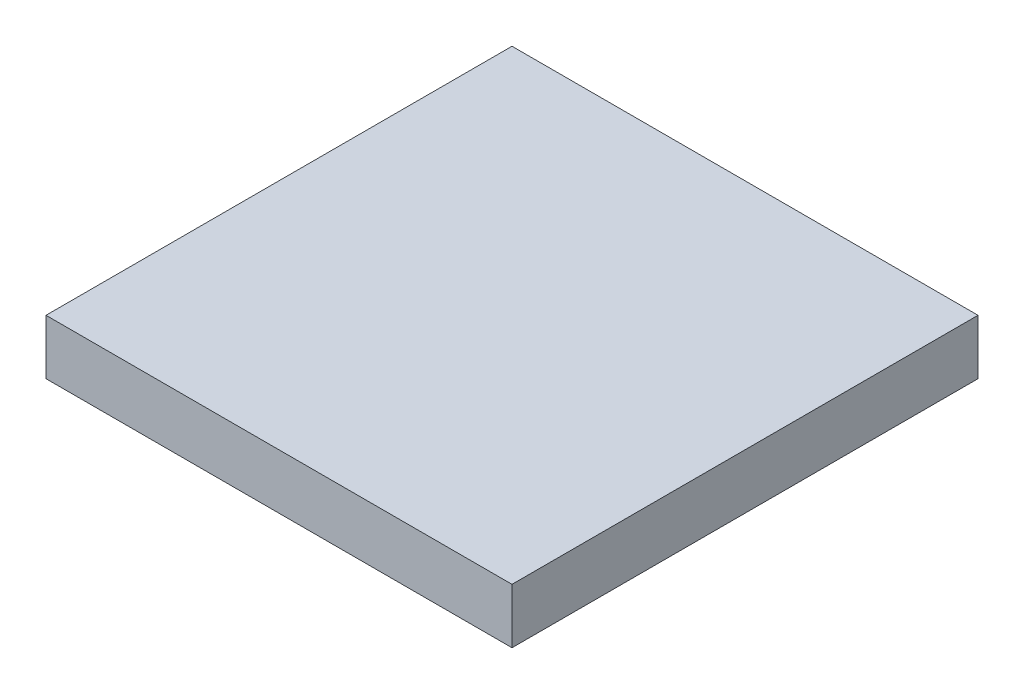
ISO-10303-21;
HEADER;
FILE_DESCRIPTION(('STEP AP214'),'2;1');
FILE_NAME('part.step','',(''),(''),'','','');
FILE_SCHEMA(('AUTOMOTIVE_DESIGN { 1 0 10303 214 1 1 1 1 }'));
ENDSEC;
DATA;
#1=APPLICATION_CONTEXT('core data for automotive mechanical design processes');
#2=APPLICATION_PROTOCOL_DEFINITION('international standard','automotive_design',2000,#1);
#3=PRODUCT_CONTEXT('',#1,'mechanical');
#4=PRODUCT('Part','Part','',(#3));
#5=PRODUCT_RELATED_PRODUCT_CATEGORY('part','',(#4));
#6=PRODUCT_DEFINITION_FORMATION('','',#4);
#7=PRODUCT_DEFINITION_CONTEXT('part definition',#1,'design');
#8=PRODUCT_DEFINITION('design','',#6,#7);
#9=PRODUCT_DEFINITION_SHAPE('','',#8);
#10=(LENGTH_UNIT() NAMED_UNIT(*) SI_UNIT(.MILLI.,.METRE.));
#11=(NAMED_UNIT(*) PLANE_ANGLE_UNIT() SI_UNIT($,.RADIAN.));
#12=(NAMED_UNIT(*) SI_UNIT($,.STERADIAN.) SOLID_ANGLE_UNIT());
#13=UNCERTAINTY_MEASURE_WITH_UNIT(LENGTH_MEASURE(1.E-05),#10,'distance_accuracy_value','');
#14=(GEOMETRIC_REPRESENTATION_CONTEXT(3) GLOBAL_UNCERTAINTY_ASSIGNED_CONTEXT((#13)) GLOBAL_UNIT_ASSIGNED_CONTEXT((#10,
#11,#12)) REPRESENTATION_CONTEXT('',''));
#15=CARTESIAN_POINT('',(0.,0.,0.));
#16=DIRECTION('',(0.,0.,1.));
#17=DIRECTION('',(1.,0.,0.));
#18=AXIS2_PLACEMENT_3D('',#15,#16,#17);
#19=CARTESIAN_POINT('',(1.3040420762004,8.17060732929226,34.5373110434945));
#20=DIRECTION('',(0.,1.,0.));
#21=DIRECTION('',(1.,0.,0.));
#22=AXIS2_PLACEMENT_3D('',#19,#20,#21);
#23=PLANE('',#22);
#24=DIRECTION('',(1.,0.,0.));
#25=VECTOR('',#24,1.);
#26=CARTESIAN_POINT('',(1.66377375309118,8.17060732929226,42.1535957080219));
#27=LINE('',#26,#25);
#28=CARTESIAN_POINT('',(-3.08622624690882,8.17060732929226,42.1535957080219));
#29=VERTEX_POINT('',#28);
#30=CARTESIAN_POINT('',(1.66377375309118,8.17060732929226,42.1535957080219));
#31=VERTEX_POINT('',#30);
#32=EDGE_CURVE('E90',#29,#31,#27,.T.);
#33=ORIENTED_EDGE('',*,*,#32,.T.);
#34=DIRECTION('',(0.,0.,-1.));
#35=VECTOR('',#34,1.);
#36=CARTESIAN_POINT('',(1.66377375309118,8.17060732929226,46.9035957080219));
#37=LINE('',#36,#35);
#38=CARTESIAN_POINT('',(1.66377375309118,8.17060732929226,46.9035957080219));
#39=VERTEX_POINT('',#38);
#40=EDGE_CURVE('E70',#31,#39,#37,.F.);
#41=ORIENTED_EDGE('',*,*,#40,.T.);
#42=DIRECTION('',(1.,0.,0.));
#43=VECTOR('',#42,1.);
#44=CARTESIAN_POINT('',(1.66377375309118,8.17060732929226,46.9035957080219));
#45=LINE('',#44,#43);
#46=CARTESIAN_POINT('',(-3.08622624690882,8.17060732929226,46.9035957080219));
#47=VERTEX_POINT('',#46);
#48=EDGE_CURVE('E56',#39,#47,#45,.F.);
#49=ORIENTED_EDGE('',*,*,#48,.T.);
#50=DIRECTION('',(0.,0.,-1.));
#51=VECTOR('',#50,1.);
#52=CARTESIAN_POINT('',(-3.08622624690882,8.17060732929226,46.9035957080219));
#53=LINE('',#52,#51);
#54=EDGE_CURVE('E20',#47,#29,#53,.T.);
#55=ORIENTED_EDGE('',*,*,#54,.T.);
#56=EDGE_LOOP('',(#33,#41,#49,#55));
#57=FACE_BOUND('',#56,.T.);
#58=ADVANCED_FACE('F17',(#57),#23,.F.);
#59=CARTESIAN_POINT('',(-3.08622624690882,8.73060732929226,46.9035957080219));
#60=DIRECTION('',(1.,0.,0.));
#61=DIRECTION('',(0.,-1.,0.));
#62=AXIS2_PLACEMENT_3D('',#59,#60,#61);
#63=PLANE('',#62);
#64=DIRECTION('',(0.,1.,0.));
#65=VECTOR('',#64,1.);
#66=CARTESIAN_POINT('',(-3.08622624690882,8.73060732929226,46.9035957080219));
#67=LINE('',#66,#65);
#68=CARTESIAN_POINT('',(-3.08622624690882,8.73060732929226,46.9035957080219));
#69=VERTEX_POINT('',#68);
#70=EDGE_CURVE('E62',#47,#69,#67,.T.);
#71=ORIENTED_EDGE('',*,*,#70,.T.);
#72=DIRECTION('',(0.,0.,-1.));
#73=VECTOR('',#72,1.);
#74=CARTESIAN_POINT('',(-3.08622624690882,8.73060732929226,34.5373110434945));
#75=LINE('',#74,#73);
#76=CARTESIAN_POINT('',(-3.08622624690882,8.73060732929226,42.1535957080219));
#77=VERTEX_POINT('',#76);
#78=EDGE_CURVE('E93',#77,#69,#75,.F.);
#79=ORIENTED_EDGE('',*,*,#78,.F.);
#80=DIRECTION('',(0.,1.,0.));
#81=VECTOR('',#80,1.);
#82=CARTESIAN_POINT('',(-3.08622624690882,8.73060732929226,42.1535957080219));
#83=LINE('',#82,#81);
#84=EDGE_CURVE('E65',#77,#29,#83,.F.);
#85=ORIENTED_EDGE('',*,*,#84,.T.);
#86=ORIENTED_EDGE('',*,*,#54,.F.);
#87=EDGE_LOOP('',(#71,#79,#85,#86));
#88=FACE_BOUND('',#87,.T.);
#89=ADVANCED_FACE('F61',(#88),#63,.F.);
#90=CARTESIAN_POINT('',(1.66377375309118,8.73060732929226,46.9035957080219));
#91=DIRECTION('',(0.,0.,-1.));
#92=DIRECTION('',(0.,1.,0.));
#93=AXIS2_PLACEMENT_3D('',#90,#91,#92);
#94=PLANE('',#93);
#95=DIRECTION('',(0.,1.,0.));
#96=VECTOR('',#95,1.);
#97=CARTESIAN_POINT('',(1.66377375309118,8.73060732929226,46.9035957080219));
#98=LINE('',#97,#96);
#99=CARTESIAN_POINT('',(1.66377375309118,8.73060732929226,46.9035957080219));
#100=VERTEX_POINT('',#99);
#101=EDGE_CURVE('E73',#39,#100,#98,.T.);
#102=ORIENTED_EDGE('',*,*,#101,.T.);
#103=DIRECTION('',(1.,0.,0.));
#104=VECTOR('',#103,1.);
#105=CARTESIAN_POINT('',(1.3040420762004,8.73060732929226,46.9035957080219));
#106=LINE('',#105,#104);
#107=EDGE_CURVE('E77',#69,#100,#106,.T.);
#108=ORIENTED_EDGE('',*,*,#107,.F.);
#109=ORIENTED_EDGE('',*,*,#70,.F.);
#110=ORIENTED_EDGE('',*,*,#48,.F.);
#111=EDGE_LOOP('',(#102,#108,#109,#110));
#112=FACE_BOUND('',#111,.T.);
#113=ADVANCED_FACE('F75',(#112),#94,.F.);
#114=CARTESIAN_POINT('',(1.66377375309118,8.73060732929226,46.9035957080219));
#115=DIRECTION('',(-1.,0.,0.));
#116=DIRECTION('',(0.,1.,0.));
#117=AXIS2_PLACEMENT_3D('',#114,#115,#116);
#118=PLANE('',#117);
#119=DIRECTION('',(0.,1.,0.));
#120=VECTOR('',#119,1.);
#121=CARTESIAN_POINT('',(1.66377375309118,8.73060732929226,42.1535957080219));
#122=LINE('',#121,#120);
#123=CARTESIAN_POINT('',(1.66377375309118,8.73060732929226,42.1535957080219));
#124=VERTEX_POINT('',#123);
#125=EDGE_CURVE('E36',#31,#124,#122,.T.);
#126=ORIENTED_EDGE('',*,*,#125,.T.);
#127=DIRECTION('',(0.,0.,-1.));
#128=VECTOR('',#127,1.);
#129=CARTESIAN_POINT('',(1.66377375309118,8.73060732929226,34.5373110434945));
#130=LINE('',#129,#128);
#131=EDGE_CURVE('E27',#100,#124,#130,.T.);
#132=ORIENTED_EDGE('',*,*,#131,.F.);
#133=ORIENTED_EDGE('',*,*,#101,.F.);
#134=ORIENTED_EDGE('',*,*,#40,.F.);
#135=EDGE_LOOP('',(#126,#132,#133,#134));
#136=FACE_BOUND('',#135,.T.);
#137=ADVANCED_FACE('F102',(#136),#118,.F.);
#138=CARTESIAN_POINT('',(1.66377375309118,8.73060732929226,42.1535957080219));
#139=DIRECTION('',(0.,0.,1.));
#140=DIRECTION('',(1.,0.,0.));
#141=AXIS2_PLACEMENT_3D('',#138,#139,#140);
#142=PLANE('',#141);
#143=ORIENTED_EDGE('',*,*,#84,.F.);
#144=DIRECTION('',(1.,0.,0.));
#145=VECTOR('',#144,1.);
#146=CARTESIAN_POINT('',(1.3040420762004,8.73060732929226,42.1535957080219));
#147=LINE('',#146,#145);
#148=EDGE_CURVE('E11',#124,#77,#147,.F.);
#149=ORIENTED_EDGE('',*,*,#148,.F.);
#150=ORIENTED_EDGE('',*,*,#125,.F.);
#151=ORIENTED_EDGE('',*,*,#32,.F.);
#152=EDGE_LOOP('',(#143,#149,#150,#151));
#153=FACE_BOUND('',#152,.T.);
#154=ADVANCED_FACE('F104',(#153),#142,.F.);
#155=CARTESIAN_POINT('',(1.3040420762004,8.73060732929226,34.5373110434945));
#156=DIRECTION('',(0.,1.,0.));
#157=DIRECTION('',(1.,0.,0.));
#158=AXIS2_PLACEMENT_3D('',#155,#156,#157);
#159=PLANE('',#158);
#160=ORIENTED_EDGE('',*,*,#131,.T.);
#161=ORIENTED_EDGE('',*,*,#148,.T.);
#162=ORIENTED_EDGE('',*,*,#78,.T.);
#163=ORIENTED_EDGE('',*,*,#107,.T.);
#164=EDGE_LOOP('',(#160,#161,#162,#163));
#165=FACE_BOUND('',#164,.T.);
#166=ADVANCED_FACE('F101',(#165),#159,.T.);
#167=CLOSED_SHELL('',(#58,#89,#113,#137,#154,#166));
#168=MANIFOLD_SOLID_BREP('B1',#167);
#169=ADVANCED_BREP_SHAPE_REPRESENTATION('',(#18,#168),#14);
#170=SHAPE_DEFINITION_REPRESENTATION(#9,#169);
ENDSEC;
END-ISO-10303-21;
